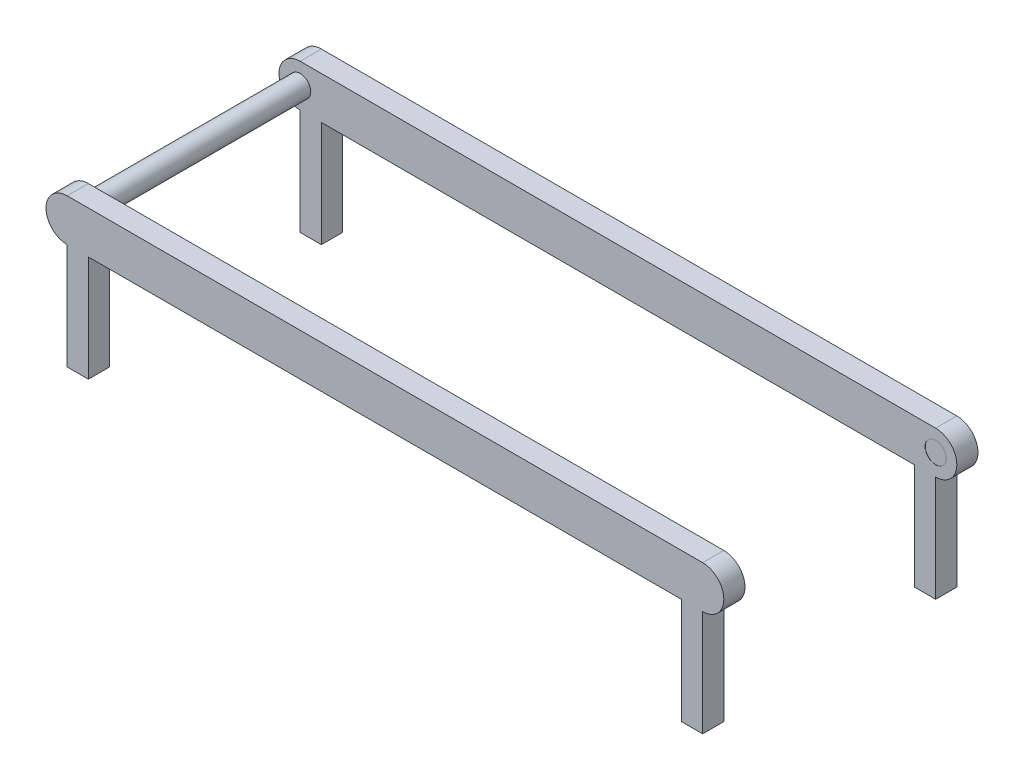
ISO-10303-21;
HEADER;
FILE_DESCRIPTION(('STEP AP214'),'2;1');
FILE_NAME('part.step','',(''),(''),'','','');
FILE_SCHEMA(('AUTOMOTIVE_DESIGN { 1 0 10303 214 1 1 1 1 }'));
ENDSEC;
DATA;
#1=APPLICATION_CONTEXT('core data for automotive mechanical design processes');
#2=APPLICATION_PROTOCOL_DEFINITION('international standard','automotive_design',2000,#1);
#3=PRODUCT_CONTEXT('',#1,'mechanical');
#4=PRODUCT('Part','Part','',(#3));
#5=PRODUCT_RELATED_PRODUCT_CATEGORY('part','',(#4));
#6=PRODUCT_DEFINITION_FORMATION('','',#4);
#7=PRODUCT_DEFINITION_CONTEXT('part definition',#1,'design');
#8=PRODUCT_DEFINITION('design','',#6,#7);
#9=PRODUCT_DEFINITION_SHAPE('','',#8);
#10=(LENGTH_UNIT() NAMED_UNIT(*) SI_UNIT(.MILLI.,.METRE.));
#11=(NAMED_UNIT(*) PLANE_ANGLE_UNIT() SI_UNIT($,.RADIAN.));
#12=(NAMED_UNIT(*) SI_UNIT($,.STERADIAN.) SOLID_ANGLE_UNIT());
#13=UNCERTAINTY_MEASURE_WITH_UNIT(LENGTH_MEASURE(1.E-05),#10,'distance_accuracy_value','');
#14=(GEOMETRIC_REPRESENTATION_CONTEXT(3) GLOBAL_UNCERTAINTY_ASSIGNED_CONTEXT((#13)) GLOBAL_UNIT_ASSIGNED_CONTEXT((#10,
#11,#12)) REPRESENTATION_CONTEXT('',''));
#15=CARTESIAN_POINT('',(0.,0.,0.));
#16=DIRECTION('',(0.,0.,1.));
#17=DIRECTION('',(1.,0.,0.));
#18=AXIS2_PLACEMENT_3D('',#15,#16,#17);
#19=CARTESIAN_POINT('',(-150.,-10.,10.));
#20=DIRECTION('',(0.,1.,0.));
#21=DIRECTION('',(0.,0.,1.));
#22=AXIS2_PLACEMENT_3D('',#19,#20,#21);
#23=PLANE('',#22);
#24=DIRECTION('',(0.,0.,1.));
#25=VECTOR('',#24,1.);
#26=CARTESIAN_POINT('',(-140.,-10.,0.));
#27=LINE('',#26,#25);
#28=CARTESIAN_POINT('',(-140.,-10.,0.));
#29=VERTEX_POINT('',#28);
#30=CARTESIAN_POINT('',(-140.,-10.,10.));
#31=VERTEX_POINT('',#30);
#32=EDGE_CURVE('E190',#29,#31,#27,.T.);
#33=ORIENTED_EDGE('',*,*,#32,.F.);
#34=DIRECTION('',(1.,0.,0.));
#35=VECTOR('',#34,1.);
#36=CARTESIAN_POINT('',(-150.,-10.,0.));
#37=LINE('',#36,#35);
#38=CARTESIAN_POINT('',(140.,-10.,0.));
#39=VERTEX_POINT('',#38);
#40=EDGE_CURVE('E319',#29,#39,#37,.T.);
#41=ORIENTED_EDGE('',*,*,#40,.T.);
#42=DIRECTION('',(0.,0.,-1.));
#43=VECTOR('',#42,1.);
#44=CARTESIAN_POINT('',(140.,-10.0000000000001,0.));
#45=LINE('',#44,#43);
#46=CARTESIAN_POINT('',(140.,-10.,10.));
#47=VERTEX_POINT('',#46);
#48=EDGE_CURVE('E194',#47,#39,#45,.T.);
#49=ORIENTED_EDGE('',*,*,#48,.F.);
#50=DIRECTION('',(1.,0.,0.));
#51=VECTOR('',#50,1.);
#52=CARTESIAN_POINT('',(-150.,-10.,10.));
#53=LINE('',#52,#51);
#54=EDGE_CURVE('E48',#31,#47,#53,.T.);
#55=ORIENTED_EDGE('',*,*,#54,.F.);
#56=EDGE_LOOP('',(#33,#41,#49,#55));
#57=FACE_BOUND('',#56,.T.);
#58=ADVANCED_FACE('F33',(#57),#23,.F.);
#59=CARTESIAN_POINT('',(-150.,-10.,120.));
#60=DIRECTION('',(0.,1.,0.));
#61=DIRECTION('',(-1.,0.,0.));
#62=AXIS2_PLACEMENT_3D('',#59,#60,#61);
#63=PLANE('',#62);
#64=DIRECTION('',(0.,0.,-1.));
#65=VECTOR('',#64,1.);
#66=CARTESIAN_POINT('',(140.,-10.0000000000001,110.));
#67=LINE('',#66,#65);
#68=CARTESIAN_POINT('',(140.,-10.0000000000001,120.));
#69=VERTEX_POINT('',#68);
#70=CARTESIAN_POINT('',(140.,-10.0000000000001,110.));
#71=VERTEX_POINT('',#70);
#72=EDGE_CURVE('E223',#69,#71,#67,.T.);
#73=ORIENTED_EDGE('',*,*,#72,.F.);
#74=DIRECTION('',(1.,0.,0.));
#75=VECTOR('',#74,1.);
#76=CARTESIAN_POINT('',(-150.,-10.,120.));
#77=LINE('',#76,#75);
#78=CARTESIAN_POINT('',(-140.,-10.,120.));
#79=VERTEX_POINT('',#78);
#80=EDGE_CURVE('E280',#79,#69,#77,.T.);
#81=ORIENTED_EDGE('',*,*,#80,.F.);
#82=DIRECTION('',(0.,0.,1.));
#83=VECTOR('',#82,1.);
#84=CARTESIAN_POINT('',(-140.,-10.,120.));
#85=LINE('',#84,#83);
#86=CARTESIAN_POINT('',(-140.,-10.,110.));
#87=VERTEX_POINT('',#86);
#88=EDGE_CURVE('E247',#87,#79,#85,.T.);
#89=ORIENTED_EDGE('',*,*,#88,.F.);
#90=DIRECTION('',(1.,0.,0.));
#91=VECTOR('',#90,1.);
#92=CARTESIAN_POINT('',(-150.,-10.,110.));
#93=LINE('',#92,#91);
#94=EDGE_CURVE('E276',#87,#71,#93,.T.);
#95=ORIENTED_EDGE('',*,*,#94,.T.);
#96=EDGE_LOOP('',(#73,#81,#89,#95));
#97=FACE_BOUND('',#96,.T.);
#98=ADVANCED_FACE('F397',(#97),#63,.F.);
#99=CARTESIAN_POINT('',(-150.,0.,10.));
#100=DIRECTION('',(0.,0.,-1.));
#101=DIRECTION('',(-1.,0.,0.));
#102=AXIS2_PLACEMENT_3D('',#99,#100,#101);
#103=CYLINDRICAL_SURFACE('',#102,10.);
#104=CARTESIAN_POINT('',(-150.,0.,0.));
#105=DIRECTION('',(0.,0.,1.));
#106=DIRECTION('',(1.,0.,0.));
#107=AXIS2_PLACEMENT_3D('',#104,#105,#106);
#108=CIRCLE('',#107,10.);
#109=CARTESIAN_POINT('',(-150.,10.,0.));
#110=VERTEX_POINT('',#109);
#111=CARTESIAN_POINT('',(-150.,-10.,0.));
#112=VERTEX_POINT('',#111);
#113=EDGE_CURVE('E306',#110,#112,#108,.T.);
#114=ORIENTED_EDGE('',*,*,#113,.T.);
#115=DIRECTION('',(0.,0.,-1.));
#116=VECTOR('',#115,1.);
#117=CARTESIAN_POINT('',(-150.,-10.,10.));
#118=LINE('',#117,#116);
#119=CARTESIAN_POINT('',(-150.,-10.,10.));
#120=VERTEX_POINT('',#119);
#121=EDGE_CURVE('E11',#120,#112,#118,.T.);
#122=ORIENTED_EDGE('',*,*,#121,.F.);
#123=CARTESIAN_POINT('',(-150.,0.,10.));
#124=DIRECTION('',(0.,0.,1.));
#125=DIRECTION('',(1.,0.,0.));
#126=AXIS2_PLACEMENT_3D('',#123,#124,#125);
#127=CIRCLE('',#126,10.);
#128=CARTESIAN_POINT('',(-150.,10.,10.));
#129=VERTEX_POINT('',#128);
#130=EDGE_CURVE('E309',#129,#120,#127,.T.);
#131=ORIENTED_EDGE('',*,*,#130,.F.);
#132=DIRECTION('',(0.,0.,-1.));
#133=VECTOR('',#132,1.);
#134=CARTESIAN_POINT('',(-150.,10.,10.));
#135=LINE('',#134,#133);
#136=EDGE_CURVE('E317',#129,#110,#135,.T.);
#137=ORIENTED_EDGE('',*,*,#136,.T.);
#138=EDGE_LOOP('',(#114,#122,#131,#137));
#139=FACE_BOUND('',#138,.T.);
#140=ADVANCED_FACE('F35',(#139),#103,.T.);
#141=CARTESIAN_POINT('',(150.,0.,10.));
#142=DIRECTION('',(0.,0.,-1.));
#143=DIRECTION('',(-1.,0.,0.));
#144=AXIS2_PLACEMENT_3D('',#141,#142,#143);
#145=CYLINDRICAL_SURFACE('',#144,10.);
#146=CARTESIAN_POINT('',(150.,0.,0.));
#147=DIRECTION('',(0.,0.,1.));
#148=DIRECTION('',(1.,0.,0.));
#149=AXIS2_PLACEMENT_3D('',#146,#147,#148);
#150=CIRCLE('',#149,10.);
#151=CARTESIAN_POINT('',(150.,-10.0000000000001,0.));
#152=VERTEX_POINT('',#151);
#153=CARTESIAN_POINT('',(150.,10.,0.));
#154=VERTEX_POINT('',#153);
#155=EDGE_CURVE('E321',#152,#154,#150,.T.);
#156=ORIENTED_EDGE('',*,*,#155,.T.);
#157=DIRECTION('',(0.,0.,-1.));
#158=VECTOR('',#157,1.);
#159=CARTESIAN_POINT('',(150.,10.,10.));
#160=LINE('',#159,#158);
#161=CARTESIAN_POINT('',(150.,10.,10.));
#162=VERTEX_POINT('',#161);
#163=EDGE_CURVE('E326',#162,#154,#160,.T.);
#164=ORIENTED_EDGE('',*,*,#163,.F.);
#165=CARTESIAN_POINT('',(150.,0.,10.));
#166=DIRECTION('',(0.,0.,1.));
#167=DIRECTION('',(1.,0.,0.));
#168=AXIS2_PLACEMENT_3D('',#165,#166,#167);
#169=CIRCLE('',#168,10.);
#170=CARTESIAN_POINT('',(150.,-10.0000000000001,10.));
#171=VERTEX_POINT('',#170);
#172=EDGE_CURVE('E313',#171,#162,#169,.T.);
#173=ORIENTED_EDGE('',*,*,#172,.F.);
#174=DIRECTION('',(0.,0.,-1.));
#175=VECTOR('',#174,1.);
#176=CARTESIAN_POINT('',(150.,-10.0000000000001,10.));
#177=LINE('',#176,#175);
#178=EDGE_CURVE('E41',#171,#152,#177,.T.);
#179=ORIENTED_EDGE('',*,*,#178,.T.);
#180=EDGE_LOOP('',(#156,#164,#173,#179));
#181=FACE_BOUND('',#180,.T.);
#182=ADVANCED_FACE('F331',(#181),#145,.T.);
#183=CARTESIAN_POINT('',(-150.,10.,10.));
#184=DIRECTION('',(0.,-1.,0.));
#185=DIRECTION('',(0.,0.,-1.));
#186=AXIS2_PLACEMENT_3D('',#183,#184,#185);
#187=PLANE('',#186);
#188=DIRECTION('',(-1.,0.,0.));
#189=VECTOR('',#188,1.);
#190=CARTESIAN_POINT('',(-150.,10.,0.));
#191=LINE('',#190,#189);
#192=EDGE_CURVE('E311',#154,#110,#191,.T.);
#193=ORIENTED_EDGE('',*,*,#192,.T.);
#194=ORIENTED_EDGE('',*,*,#136,.F.);
#195=DIRECTION('',(-1.,0.,0.));
#196=VECTOR('',#195,1.);
#197=CARTESIAN_POINT('',(-150.,10.,10.));
#198=LINE('',#197,#196);
#199=EDGE_CURVE('E315',#162,#129,#198,.T.);
#200=ORIENTED_EDGE('',*,*,#199,.F.);
#201=ORIENTED_EDGE('',*,*,#163,.T.);
#202=EDGE_LOOP('',(#193,#194,#200,#201));
#203=FACE_BOUND('',#202,.T.);
#204=ADVANCED_FACE('F342',(#203),#187,.F.);
#205=CARTESIAN_POINT('',(-150.,0.,10.));
#206=DIRECTION('',(0.,0.,1.));
#207=DIRECTION('',(1.,0.,0.));
#208=AXIS2_PLACEMENT_3D('',#205,#206,#207);
#209=PLANE('',#208);
#210=CARTESIAN_POINT('',(150.,0.,10.));
#211=DIRECTION('',(0.,0.,1.));
#212=DIRECTION('',(1.,0.,0.));
#213=AXIS2_PLACEMENT_3D('',#210,#211,#212);
#214=CIRCLE('',#213,5.00000000000002);
#215=CARTESIAN_POINT('',(155.,0.,10.));
#216=VERTEX_POINT('',#215);
#217=EDGE_CURVE('E363',#216,#216,#214,.T.);
#218=ORIENTED_EDGE('',*,*,#217,.F.);
#219=EDGE_LOOP('',(#218));
#220=FACE_BOUND('',#219,.T.);
#221=CARTESIAN_POINT('',(-150.,0.,10.));
#222=DIRECTION('',(0.,0.,1.));
#223=DIRECTION('',(1.,0.,0.));
#224=AXIS2_PLACEMENT_3D('',#221,#222,#223);
#225=CIRCLE('',#224,4.99999999999999);
#226=CARTESIAN_POINT('',(-145.,0.,10.));
#227=VERTEX_POINT('',#226);
#228=EDGE_CURVE('E302',#227,#227,#225,.T.);
#229=ORIENTED_EDGE('',*,*,#228,.F.);
#230=EDGE_LOOP('',(#229));
#231=FACE_BOUND('',#230,.T.);
#232=ORIENTED_EDGE('',*,*,#130,.T.);
#233=DIRECTION('',(0.,1.,0.));
#234=VECTOR('',#233,1.);
#235=CARTESIAN_POINT('',(-150.,-60.,10.));
#236=LINE('',#235,#234);
#237=CARTESIAN_POINT('',(-150.,-60.,10.));
#238=VERTEX_POINT('',#237);
#239=EDGE_CURVE('E347',#238,#120,#236,.T.);
#240=ORIENTED_EDGE('',*,*,#239,.F.);
#241=DIRECTION('',(-1.,0.,0.));
#242=VECTOR('',#241,1.);
#243=CARTESIAN_POINT('',(-150.,-60.,10.));
#244=LINE('',#243,#242);
#245=CARTESIAN_POINT('',(-140.,-60.,10.));
#246=VERTEX_POINT('',#245);
#247=EDGE_CURVE('E186',#246,#238,#244,.T.);
#248=ORIENTED_EDGE('',*,*,#247,.F.);
#249=DIRECTION('',(0.,1.,0.));
#250=VECTOR('',#249,1.);
#251=CARTESIAN_POINT('',(-140.,-60.,10.));
#252=LINE('',#251,#250);
#253=EDGE_CURVE('E199',#246,#31,#252,.T.);
#254=ORIENTED_EDGE('',*,*,#253,.T.);
#255=ORIENTED_EDGE('',*,*,#54,.T.);
#256=DIRECTION('',(0.,1.,0.));
#257=VECTOR('',#256,1.);
#258=CARTESIAN_POINT('',(140.,-60.0000000000001,10.));
#259=LINE('',#258,#257);
#260=CARTESIAN_POINT('',(140.,-60.0000000000001,10.));
#261=VERTEX_POINT('',#260);
#262=EDGE_CURVE('E217',#261,#47,#259,.T.);
#263=ORIENTED_EDGE('',*,*,#262,.F.);
#264=DIRECTION('',(-1.,0.,0.));
#265=VECTOR('',#264,1.);
#266=CARTESIAN_POINT('',(150.,-60.0000000000001,10.));
#267=LINE('',#266,#265);
#268=CARTESIAN_POINT('',(150.,-60.0000000000001,10.));
#269=VERTEX_POINT('',#268);
#270=EDGE_CURVE('E205',#269,#261,#267,.T.);
#271=ORIENTED_EDGE('',*,*,#270,.F.);
#272=DIRECTION('',(0.,1.,0.));
#273=VECTOR('',#272,1.);
#274=CARTESIAN_POINT('',(150.,-60.0000000000001,10.));
#275=LINE('',#274,#273);
#276=EDGE_CURVE('E220',#269,#171,#275,.T.);
#277=ORIENTED_EDGE('',*,*,#276,.T.);
#278=ORIENTED_EDGE('',*,*,#172,.T.);
#279=ORIENTED_EDGE('',*,*,#199,.T.);
#280=EDGE_LOOP('',(#232,#240,#248,#254,#255,#263,#271,#277,#278,#279));
#281=FACE_BOUND('',#280,.T.);
#282=ADVANCED_FACE('F346',(#220,#231,#281),#209,.T.);
#283=CARTESIAN_POINT('',(-150.,0.,0.));
#284=DIRECTION('',(0.,0.,1.));
#285=DIRECTION('',(1.,0.,0.));
#286=AXIS2_PLACEMENT_3D('',#283,#284,#285);
#287=PLANE('',#286);
#288=ORIENTED_EDGE('',*,*,#113,.F.);
#289=ORIENTED_EDGE('',*,*,#192,.F.);
#290=ORIENTED_EDGE('',*,*,#155,.F.);
#291=DIRECTION('',(0.,1.,0.));
#292=VECTOR('',#291,1.);
#293=CARTESIAN_POINT('',(150.,-60.0000000000001,0.));
#294=LINE('',#293,#292);
#295=CARTESIAN_POINT('',(150.,-60.0000000000001,0.));
#296=VERTEX_POINT('',#295);
#297=EDGE_CURVE('E210',#296,#152,#294,.T.);
#298=ORIENTED_EDGE('',*,*,#297,.F.);
#299=DIRECTION('',(1.,0.,0.));
#300=VECTOR('',#299,1.);
#301=CARTESIAN_POINT('',(150.,-60.0000000000001,0.));
#302=LINE('',#301,#300);
#303=CARTESIAN_POINT('',(140.,-60.0000000000001,0.));
#304=VERTEX_POINT('',#303);
#305=EDGE_CURVE('E209',#304,#296,#302,.T.);
#306=ORIENTED_EDGE('',*,*,#305,.F.);
#307=DIRECTION('',(0.,1.,0.));
#308=VECTOR('',#307,1.);
#309=CARTESIAN_POINT('',(140.,-60.0000000000001,0.));
#310=LINE('',#309,#308);
#311=EDGE_CURVE('E214',#304,#39,#310,.T.);
#312=ORIENTED_EDGE('',*,*,#311,.T.);
#313=ORIENTED_EDGE('',*,*,#40,.F.);
#314=DIRECTION('',(0.,1.,0.));
#315=VECTOR('',#314,1.);
#316=CARTESIAN_POINT('',(-140.,-60.,0.));
#317=LINE('',#316,#315);
#318=CARTESIAN_POINT('',(-140.,-60.,0.));
#319=VERTEX_POINT('',#318);
#320=EDGE_CURVE('E177',#319,#29,#317,.T.);
#321=ORIENTED_EDGE('',*,*,#320,.F.);
#322=DIRECTION('',(1.,0.,0.));
#323=VECTOR('',#322,1.);
#324=CARTESIAN_POINT('',(-150.,-60.,0.));
#325=LINE('',#324,#323);
#326=CARTESIAN_POINT('',(-150.,-60.,0.));
#327=VERTEX_POINT('',#326);
#328=EDGE_CURVE('E170',#327,#319,#325,.T.);
#329=ORIENTED_EDGE('',*,*,#328,.F.);
#330=DIRECTION('',(0.,1.,0.));
#331=VECTOR('',#330,1.);
#332=CARTESIAN_POINT('',(-150.,-60.,0.));
#333=LINE('',#332,#331);
#334=EDGE_CURVE('E175',#327,#112,#333,.T.);
#335=ORIENTED_EDGE('',*,*,#334,.T.);
#336=EDGE_LOOP('',(#288,#289,#290,#298,#306,#312,#313,#321,#329,#335));
#337=FACE_BOUND('',#336,.T.);
#338=ADVANCED_FACE('F173',(#337),#287,.F.);
#339=CARTESIAN_POINT('',(-150.,0.,110.));
#340=DIRECTION('',(0.,0.,-1.));
#341=DIRECTION('',(-1.,0.,0.));
#342=AXIS2_PLACEMENT_3D('',#339,#340,#341);
#343=CYLINDRICAL_SURFACE('',#342,4.99999999999999);
#344=CARTESIAN_POINT('',(-150.,0.,110.));
#345=DIRECTION('',(0.,0.,1.));
#346=DIRECTION('',(1.,0.,0.));
#347=AXIS2_PLACEMENT_3D('',#344,#345,#346);
#348=CIRCLE('',#347,4.99999999999999);
#349=CARTESIAN_POINT('',(-145.,0.,110.));
#350=VERTEX_POINT('',#349);
#351=EDGE_CURVE('E303',#350,#350,#348,.T.);
#352=ORIENTED_EDGE('',*,*,#351,.F.);
#353=EDGE_LOOP('',(#352));
#354=FACE_BOUND('',#353,.T.);
#355=ORIENTED_EDGE('',*,*,#228,.T.);
#356=EDGE_LOOP('',(#355));
#357=FACE_BOUND('',#356,.T.);
#358=ADVANCED_FACE('F382',(#354,#357),#343,.T.);
#359=CARTESIAN_POINT('',(150.,0.,120.));
#360=DIRECTION('',(0.,0.,-1.));
#361=DIRECTION('',(-1.,0.,0.));
#362=AXIS2_PLACEMENT_3D('',#359,#360,#361);
#363=CYLINDRICAL_SURFACE('',#362,10.);
#364=CARTESIAN_POINT('',(150.,0.,110.));
#365=DIRECTION('',(0.,0.,1.));
#366=DIRECTION('',(1.,0.,0.));
#367=AXIS2_PLACEMENT_3D('',#364,#365,#366);
#368=CIRCLE('',#367,10.);
#369=CARTESIAN_POINT('',(150.,-10.0000000000001,110.));
#370=VERTEX_POINT('',#369);
#371=CARTESIAN_POINT('',(150.,10.,110.));
#372=VERTEX_POINT('',#371);
#373=EDGE_CURVE('E271',#370,#372,#368,.T.);
#374=ORIENTED_EDGE('',*,*,#373,.T.);
#375=DIRECTION('',(0.,0.,-1.));
#376=VECTOR('',#375,1.);
#377=CARTESIAN_POINT('',(150.,10.,120.));
#378=LINE('',#377,#376);
#379=CARTESIAN_POINT('',(150.,10.,120.));
#380=VERTEX_POINT('',#379);
#381=EDGE_CURVE('E299',#380,#372,#378,.T.);
#382=ORIENTED_EDGE('',*,*,#381,.F.);
#383=CARTESIAN_POINT('',(150.,0.,120.));
#384=DIRECTION('',(0.,0.,1.));
#385=DIRECTION('',(1.,0.,0.));
#386=AXIS2_PLACEMENT_3D('',#383,#384,#385);
#387=CIRCLE('',#386,10.);
#388=CARTESIAN_POINT('',(150.,-10.0000000000001,120.));
#389=VERTEX_POINT('',#388);
#390=EDGE_CURVE('E272',#389,#380,#387,.T.);
#391=ORIENTED_EDGE('',*,*,#390,.F.);
#392=DIRECTION('',(0.,0.,-1.));
#393=VECTOR('',#392,1.);
#394=CARTESIAN_POINT('',(150.,-10.0000000000001,120.));
#395=LINE('',#394,#393);
#396=EDGE_CURVE('E283',#389,#370,#395,.T.);
#397=ORIENTED_EDGE('',*,*,#396,.T.);
#398=EDGE_LOOP('',(#374,#382,#391,#397));
#399=FACE_BOUND('',#398,.T.);
#400=ADVANCED_FACE('F384',(#399),#363,.T.);
#401=CARTESIAN_POINT('',(-150.,10.,120.));
#402=DIRECTION('',(0.,-1.,0.));
#403=DIRECTION('',(0.,0.,-1.));
#404=AXIS2_PLACEMENT_3D('',#401,#402,#403);
#405=PLANE('',#404);
#406=DIRECTION('',(-1.,0.,0.));
#407=VECTOR('',#406,1.);
#408=CARTESIAN_POINT('',(-150.,10.,110.));
#409=LINE('',#408,#407);
#410=CARTESIAN_POINT('',(-150.,10.,110.));
#411=VERTEX_POINT('',#410);
#412=EDGE_CURVE('E286',#372,#411,#409,.T.);
#413=ORIENTED_EDGE('',*,*,#412,.T.);
#414=DIRECTION('',(0.,0.,-1.));
#415=VECTOR('',#414,1.);
#416=CARTESIAN_POINT('',(-150.,10.,120.));
#417=LINE('',#416,#415);
#418=CARTESIAN_POINT('',(-150.,10.,120.));
#419=VERTEX_POINT('',#418);
#420=EDGE_CURVE('E296',#419,#411,#417,.T.);
#421=ORIENTED_EDGE('',*,*,#420,.F.);
#422=DIRECTION('',(-1.,0.,0.));
#423=VECTOR('',#422,1.);
#424=CARTESIAN_POINT('',(-150.,10.,120.));
#425=LINE('',#424,#423);
#426=EDGE_CURVE('E275',#380,#419,#425,.T.);
#427=ORIENTED_EDGE('',*,*,#426,.F.);
#428=ORIENTED_EDGE('',*,*,#381,.T.);
#429=EDGE_LOOP('',(#413,#421,#427,#428));
#430=FACE_BOUND('',#429,.T.);
#431=ADVANCED_FACE('F391',(#430),#405,.F.);
#432=CARTESIAN_POINT('',(-150.,0.,120.));
#433=DIRECTION('',(0.,0.,-1.));
#434=DIRECTION('',(-1.,0.,0.));
#435=AXIS2_PLACEMENT_3D('',#432,#433,#434);
#436=CYLINDRICAL_SURFACE('',#435,10.);
#437=CARTESIAN_POINT('',(-150.,0.,110.));
#438=DIRECTION('',(0.,0.,1.));
#439=DIRECTION('',(-1.,0.,0.));
#440=AXIS2_PLACEMENT_3D('',#437,#438,#439);
#441=CIRCLE('',#440,10.);
#442=CARTESIAN_POINT('',(-150.,-10.,110.));
#443=VERTEX_POINT('',#442);
#444=EDGE_CURVE('E288',#411,#443,#441,.T.);
#445=ORIENTED_EDGE('',*,*,#444,.T.);
#446=DIRECTION('',(0.,0.,-1.));
#447=VECTOR('',#446,1.);
#448=CARTESIAN_POINT('',(-150.,-10.,120.));
#449=LINE('',#448,#447);
#450=CARTESIAN_POINT('',(-150.,-10.,120.));
#451=VERTEX_POINT('',#450);
#452=EDGE_CURVE('E293',#451,#443,#449,.T.);
#453=ORIENTED_EDGE('',*,*,#452,.F.);
#454=CARTESIAN_POINT('',(-150.,0.,120.));
#455=DIRECTION('',(0.,0.,1.));
#456=DIRECTION('',(-1.,0.,0.));
#457=AXIS2_PLACEMENT_3D('',#454,#455,#456);
#458=CIRCLE('',#457,10.);
#459=EDGE_CURVE('E278',#419,#451,#458,.T.);
#460=ORIENTED_EDGE('',*,*,#459,.F.);
#461=ORIENTED_EDGE('',*,*,#420,.T.);
#462=EDGE_LOOP('',(#445,#453,#460,#461));
#463=FACE_BOUND('',#462,.T.);
#464=ADVANCED_FACE('F441',(#463),#436,.T.);
#465=CARTESIAN_POINT('',(150.,0.,120.));
#466=DIRECTION('',(0.,0.,1.));
#467=DIRECTION('',(1.,0.,0.));
#468=AXIS2_PLACEMENT_3D('',#465,#466,#467);
#469=PLANE('',#468);
#470=ORIENTED_EDGE('',*,*,#390,.T.);
#471=ORIENTED_EDGE('',*,*,#426,.T.);
#472=ORIENTED_EDGE('',*,*,#459,.T.);
#473=DIRECTION('',(0.,1.,0.));
#474=VECTOR('',#473,1.);
#475=CARTESIAN_POINT('',(-150.,-60.,120.));
#476=LINE('',#475,#474);
#477=CARTESIAN_POINT('',(-150.,-60.,120.));
#478=VERTEX_POINT('',#477);
#479=EDGE_CURVE('E257',#478,#451,#476,.T.);
#480=ORIENTED_EDGE('',*,*,#479,.F.);
#481=DIRECTION('',(-1.,0.,0.));
#482=VECTOR('',#481,1.);
#483=CARTESIAN_POINT('',(-150.,-60.,120.));
#484=LINE('',#483,#482);
#485=CARTESIAN_POINT('',(-140.,-60.,120.));
#486=VERTEX_POINT('',#485);
#487=EDGE_CURVE('E255',#486,#478,#484,.T.);
#488=ORIENTED_EDGE('',*,*,#487,.F.);
#489=DIRECTION('',(0.,1.,0.));
#490=VECTOR('',#489,1.);
#491=CARTESIAN_POINT('',(-140.,-60.,120.));
#492=LINE('',#491,#490);
#493=EDGE_CURVE('E262',#486,#79,#492,.T.);
#494=ORIENTED_EDGE('',*,*,#493,.T.);
#495=ORIENTED_EDGE('',*,*,#80,.T.);
#496=DIRECTION('',(0.,1.,0.));
#497=VECTOR('',#496,1.);
#498=CARTESIAN_POINT('',(140.,-60.0000000000001,120.));
#499=LINE('',#498,#497);
#500=CARTESIAN_POINT('',(140.,-60.0000000000001,120.));
#501=VERTEX_POINT('',#500);
#502=EDGE_CURVE('E241',#501,#69,#499,.T.);
#503=ORIENTED_EDGE('',*,*,#502,.F.);
#504=DIRECTION('',(-1.,0.,0.));
#505=VECTOR('',#504,1.);
#506=CARTESIAN_POINT('',(150.,-60.0000000000001,120.));
#507=LINE('',#506,#505);
#508=CARTESIAN_POINT('',(150.,-60.0000000000001,120.));
#509=VERTEX_POINT('',#508);
#510=EDGE_CURVE('E227',#509,#501,#507,.T.);
#511=ORIENTED_EDGE('',*,*,#510,.F.);
#512=DIRECTION('',(0.,1.,0.));
#513=VECTOR('',#512,1.);
#514=CARTESIAN_POINT('',(150.,-60.0000000000001,120.));
#515=LINE('',#514,#513);
#516=EDGE_CURVE('E244',#509,#389,#515,.T.);
#517=ORIENTED_EDGE('',*,*,#516,.T.);
#518=EDGE_LOOP('',(#470,#471,#472,#480,#488,#494,#495,#503,#511,#517));
#519=FACE_BOUND('',#518,.T.);
#520=ADVANCED_FACE('F446',(#519),#469,.T.);
#521=CARTESIAN_POINT('',(150.,0.,110.));
#522=DIRECTION('',(0.,0.,1.));
#523=DIRECTION('',(1.,0.,0.));
#524=AXIS2_PLACEMENT_3D('',#521,#522,#523);
#525=PLANE('',#524);
#526=ORIENTED_EDGE('',*,*,#351,.T.);
#527=EDGE_LOOP('',(#526));
#528=FACE_BOUND('',#527,.T.);
#529=ORIENTED_EDGE('',*,*,#373,.F.);
#530=DIRECTION('',(0.,1.,0.));
#531=VECTOR('',#530,1.);
#532=CARTESIAN_POINT('',(150.,-60.0000000000001,110.));
#533=LINE('',#532,#531);
#534=CARTESIAN_POINT('',(150.,-60.0000000000001,110.));
#535=VERTEX_POINT('',#534);
#536=EDGE_CURVE('E233',#535,#370,#533,.T.);
#537=ORIENTED_EDGE('',*,*,#536,.F.);
#538=DIRECTION('',(1.,0.,0.));
#539=VECTOR('',#538,1.);
#540=CARTESIAN_POINT('',(150.,-60.0000000000001,110.));
#541=LINE('',#540,#539);
#542=CARTESIAN_POINT('',(140.,-60.0000000000001,110.));
#543=VERTEX_POINT('',#542);
#544=EDGE_CURVE('E231',#543,#535,#541,.T.);
#545=ORIENTED_EDGE('',*,*,#544,.F.);
#546=DIRECTION('',(0.,1.,0.));
#547=VECTOR('',#546,1.);
#548=CARTESIAN_POINT('',(140.,-60.0000000000001,110.));
#549=LINE('',#548,#547);
#550=EDGE_CURVE('E238',#543,#71,#549,.T.);
#551=ORIENTED_EDGE('',*,*,#550,.T.);
#552=ORIENTED_EDGE('',*,*,#94,.F.);
#553=DIRECTION('',(0.,1.,0.));
#554=VECTOR('',#553,1.);
#555=CARTESIAN_POINT('',(-140.,-60.,110.));
#556=LINE('',#555,#554);
#557=CARTESIAN_POINT('',(-140.,-60.,110.));
#558=VERTEX_POINT('',#557);
#559=EDGE_CURVE('E265',#558,#87,#556,.T.);
#560=ORIENTED_EDGE('',*,*,#559,.F.);
#561=DIRECTION('',(1.,0.,0.));
#562=VECTOR('',#561,1.);
#563=CARTESIAN_POINT('',(-150.,-60.,110.));
#564=LINE('',#563,#562);
#565=CARTESIAN_POINT('',(-150.,-60.,110.));
#566=VERTEX_POINT('',#565);
#567=EDGE_CURVE('E251',#566,#558,#564,.T.);
#568=ORIENTED_EDGE('',*,*,#567,.F.);
#569=DIRECTION('',(0.,1.,0.));
#570=VECTOR('',#569,1.);
#571=CARTESIAN_POINT('',(-150.,-60.,110.));
#572=LINE('',#571,#570);
#573=EDGE_CURVE('E268',#566,#443,#572,.T.);
#574=ORIENTED_EDGE('',*,*,#573,.T.);
#575=ORIENTED_EDGE('',*,*,#444,.F.);
#576=ORIENTED_EDGE('',*,*,#412,.F.);
#577=EDGE_LOOP('',(#529,#537,#545,#551,#552,#560,#568,#574,#575,#576));
#578=FACE_BOUND('',#577,.T.);
#579=ADVANCED_FACE('F457',(#528,#578),#525,.F.);
#580=CARTESIAN_POINT('',(-150.,-60.,120.));
#581=DIRECTION('',(1.,0.,0.));
#582=DIRECTION('',(0.,1.,0.));
#583=AXIS2_PLACEMENT_3D('',#580,#581,#582);
#584=PLANE('',#583);
#585=ORIENTED_EDGE('',*,*,#452,.T.);
#586=ORIENTED_EDGE('',*,*,#573,.F.);
#587=DIRECTION('',(0.,0.,-1.));
#588=VECTOR('',#587,1.);
#589=CARTESIAN_POINT('',(-150.,-60.,120.));
#590=LINE('',#589,#588);
#591=EDGE_CURVE('E248',#478,#566,#590,.T.);
#592=ORIENTED_EDGE('',*,*,#591,.F.);
#593=ORIENTED_EDGE('',*,*,#479,.T.);
#594=EDGE_LOOP('',(#585,#586,#592,#593));
#595=FACE_BOUND('',#594,.T.);
#596=ADVANCED_FACE('F468',(#595),#584,.F.);
#597=CARTESIAN_POINT('',(-140.,-60.,120.));
#598=DIRECTION('',(-1.,0.,0.));
#599=DIRECTION('',(0.,-1.,0.));
#600=AXIS2_PLACEMENT_3D('',#597,#598,#599);
#601=PLANE('',#600);
#602=ORIENTED_EDGE('',*,*,#88,.T.);
#603=ORIENTED_EDGE('',*,*,#493,.F.);
#604=DIRECTION('',(0.,0.,1.));
#605=VECTOR('',#604,1.);
#606=CARTESIAN_POINT('',(-140.,-60.,120.));
#607=LINE('',#606,#605);
#608=EDGE_CURVE('E253',#558,#486,#607,.T.);
#609=ORIENTED_EDGE('',*,*,#608,.F.);
#610=ORIENTED_EDGE('',*,*,#559,.T.);
#611=EDGE_LOOP('',(#602,#603,#609,#610));
#612=FACE_BOUND('',#611,.T.);
#613=ADVANCED_FACE('F478',(#612),#601,.F.);
#614=CARTESIAN_POINT('',(0.,-60.,0.));
#615=DIRECTION('',(0.,-1.,0.));
#616=DIRECTION('',(0.,0.,-1.));
#617=AXIS2_PLACEMENT_3D('',#614,#615,#616);
#618=PLANE('',#617);
#619=ORIENTED_EDGE('',*,*,#591,.T.);
#620=ORIENTED_EDGE('',*,*,#567,.T.);
#621=ORIENTED_EDGE('',*,*,#608,.T.);
#622=ORIENTED_EDGE('',*,*,#487,.T.);
#623=EDGE_LOOP('',(#619,#620,#621,#622));
#624=FACE_BOUND('',#623,.T.);
#625=ADVANCED_FACE('F488',(#624),#618,.T.);
#626=CARTESIAN_POINT('',(150.,-60.0000000000001,110.));
#627=DIRECTION('',(-1.,0.,0.));
#628=DIRECTION('',(0.,-1.,0.));
#629=AXIS2_PLACEMENT_3D('',#626,#627,#628);
#630=PLANE('',#629);
#631=ORIENTED_EDGE('',*,*,#396,.F.);
#632=ORIENTED_EDGE('',*,*,#516,.F.);
#633=DIRECTION('',(0.,0.,1.));
#634=VECTOR('',#633,1.);
#635=CARTESIAN_POINT('',(150.,-60.0000000000001,110.));
#636=LINE('',#635,#634);
#637=EDGE_CURVE('E224',#535,#509,#636,.T.);
#638=ORIENTED_EDGE('',*,*,#637,.F.);
#639=ORIENTED_EDGE('',*,*,#536,.T.);
#640=EDGE_LOOP('',(#631,#632,#638,#639));
#641=FACE_BOUND('',#640,.T.);
#642=ADVANCED_FACE('F498',(#641),#630,.F.);
#643=CARTESIAN_POINT('',(140.,-60.0000000000001,110.));
#644=DIRECTION('',(1.,0.,0.));
#645=DIRECTION('',(0.,0.,-1.));
#646=AXIS2_PLACEMENT_3D('',#643,#644,#645);
#647=PLANE('',#646);
#648=ORIENTED_EDGE('',*,*,#72,.T.);
#649=ORIENTED_EDGE('',*,*,#550,.F.);
#650=DIRECTION('',(0.,0.,-1.));
#651=VECTOR('',#650,1.);
#652=CARTESIAN_POINT('',(140.,-60.0000000000001,110.));
#653=LINE('',#652,#651);
#654=EDGE_CURVE('E229',#501,#543,#653,.T.);
#655=ORIENTED_EDGE('',*,*,#654,.F.);
#656=ORIENTED_EDGE('',*,*,#502,.T.);
#657=EDGE_LOOP('',(#648,#649,#655,#656));
#658=FACE_BOUND('',#657,.T.);
#659=ADVANCED_FACE('F508',(#658),#647,.F.);
#660=CARTESIAN_POINT('',(0.,-60.0000000000001,0.));
#661=DIRECTION('',(0.,-1.,0.));
#662=DIRECTION('',(0.,0.,-1.));
#663=AXIS2_PLACEMENT_3D('',#660,#661,#662);
#664=PLANE('',#663);
#665=ORIENTED_EDGE('',*,*,#637,.T.);
#666=ORIENTED_EDGE('',*,*,#510,.T.);
#667=ORIENTED_EDGE('',*,*,#654,.T.);
#668=ORIENTED_EDGE('',*,*,#544,.T.);
#669=EDGE_LOOP('',(#665,#666,#667,#668));
#670=FACE_BOUND('',#669,.T.);
#671=ADVANCED_FACE('F518',(#670),#664,.T.);
#672=CARTESIAN_POINT('',(150.,-60.0000000000001,0.));
#673=DIRECTION('',(-1.,0.,0.));
#674=DIRECTION('',(0.,-1.,0.));
#675=AXIS2_PLACEMENT_3D('',#672,#673,#674);
#676=PLANE('',#675);
#677=ORIENTED_EDGE('',*,*,#178,.F.);
#678=ORIENTED_EDGE('',*,*,#276,.F.);
#679=DIRECTION('',(0.,0.,1.));
#680=VECTOR('',#679,1.);
#681=CARTESIAN_POINT('',(150.,-60.0000000000001,0.));
#682=LINE('',#681,#680);
#683=EDGE_CURVE('E197',#296,#269,#682,.T.);
#684=ORIENTED_EDGE('',*,*,#683,.F.);
#685=ORIENTED_EDGE('',*,*,#297,.T.);
#686=EDGE_LOOP('',(#677,#678,#684,#685));
#687=FACE_BOUND('',#686,.T.);
#688=ADVANCED_FACE('F337',(#687),#676,.F.);
#689=CARTESIAN_POINT('',(140.,-60.0000000000001,0.));
#690=DIRECTION('',(1.,0.,0.));
#691=DIRECTION('',(0.,1.,0.));
#692=AXIS2_PLACEMENT_3D('',#689,#690,#691);
#693=PLANE('',#692);
#694=ORIENTED_EDGE('',*,*,#48,.T.);
#695=ORIENTED_EDGE('',*,*,#311,.F.);
#696=DIRECTION('',(0.,0.,-1.));
#697=VECTOR('',#696,1.);
#698=CARTESIAN_POINT('',(140.,-60.0000000000001,0.));
#699=LINE('',#698,#697);
#700=EDGE_CURVE('E207',#261,#304,#699,.T.);
#701=ORIENTED_EDGE('',*,*,#700,.F.);
#702=ORIENTED_EDGE('',*,*,#262,.T.);
#703=EDGE_LOOP('',(#694,#695,#701,#702));
#704=FACE_BOUND('',#703,.T.);
#705=ADVANCED_FACE('F353',(#704),#693,.F.);
#706=CARTESIAN_POINT('',(0.,-60.0000000000001,0.));
#707=DIRECTION('',(0.,-1.,0.));
#708=DIRECTION('',(0.,0.,-1.));
#709=AXIS2_PLACEMENT_3D('',#706,#707,#708);
#710=PLANE('',#709);
#711=ORIENTED_EDGE('',*,*,#683,.T.);
#712=ORIENTED_EDGE('',*,*,#270,.T.);
#713=ORIENTED_EDGE('',*,*,#700,.T.);
#714=ORIENTED_EDGE('',*,*,#305,.T.);
#715=EDGE_LOOP('',(#711,#712,#713,#714));
#716=FACE_BOUND('',#715,.T.);
#717=ADVANCED_FACE('F350',(#716),#710,.T.);
#718=CARTESIAN_POINT('',(-150.,-60.,0.));
#719=DIRECTION('',(1.,0.,0.));
#720=DIRECTION('',(0.,1.,0.));
#721=AXIS2_PLACEMENT_3D('',#718,#719,#720);
#722=PLANE('',#721);
#723=ORIENTED_EDGE('',*,*,#121,.T.);
#724=ORIENTED_EDGE('',*,*,#334,.F.);
#725=DIRECTION('',(0.,0.,-1.));
#726=VECTOR('',#725,1.);
#727=CARTESIAN_POINT('',(-150.,-60.,0.));
#728=LINE('',#727,#726);
#729=EDGE_CURVE('E181',#238,#327,#728,.T.);
#730=ORIENTED_EDGE('',*,*,#729,.F.);
#731=ORIENTED_EDGE('',*,*,#239,.T.);
#732=EDGE_LOOP('',(#723,#724,#730,#731));
#733=FACE_BOUND('',#732,.T.);
#734=ADVANCED_FACE('F192',(#733),#722,.F.);
#735=CARTESIAN_POINT('',(-140.,-60.,0.));
#736=DIRECTION('',(-1.,0.,0.));
#737=DIRECTION('',(0.,-1.,0.));
#738=AXIS2_PLACEMENT_3D('',#735,#736,#737);
#739=PLANE('',#738);
#740=ORIENTED_EDGE('',*,*,#32,.T.);
#741=ORIENTED_EDGE('',*,*,#253,.F.);
#742=DIRECTION('',(0.,0.,1.));
#743=VECTOR('',#742,1.);
#744=CARTESIAN_POINT('',(-140.,-60.,0.));
#745=LINE('',#744,#743);
#746=EDGE_CURVE('E180',#319,#246,#745,.T.);
#747=ORIENTED_EDGE('',*,*,#746,.F.);
#748=ORIENTED_EDGE('',*,*,#320,.T.);
#749=EDGE_LOOP('',(#740,#741,#747,#748));
#750=FACE_BOUND('',#749,.T.);
#751=ADVANCED_FACE('F358',(#750),#739,.F.);
#752=CARTESIAN_POINT('',(0.,-60.,0.));
#753=DIRECTION('',(0.,1.,0.));
#754=DIRECTION('',(0.,0.,1.));
#755=AXIS2_PLACEMENT_3D('',#752,#753,#754);
#756=PLANE('',#755);
#757=ORIENTED_EDGE('',*,*,#729,.T.);
#758=ORIENTED_EDGE('',*,*,#328,.T.);
#759=ORIENTED_EDGE('',*,*,#746,.T.);
#760=ORIENTED_EDGE('',*,*,#247,.T.);
#761=EDGE_LOOP('',(#757,#758,#759,#760));
#762=FACE_BOUND('',#761,.T.);
#763=ADVANCED_FACE('F184',(#762),#756,.F.);
#764=CARTESIAN_POINT('',(150.,0.,9.9));
#765=DIRECTION('',(0.,0.,1.));
#766=DIRECTION('',(1.,0.,0.));
#767=AXIS2_PLACEMENT_3D('',#764,#765,#766);
#768=CYLINDRICAL_SURFACE('',#767,5.00000000000002);
#769=CARTESIAN_POINT('',(150.,0.,9.9));
#770=DIRECTION('',(0.,0.,1.));
#771=DIRECTION('',(1.,0.,0.));
#772=AXIS2_PLACEMENT_3D('',#769,#770,#771);
#773=CIRCLE('',#772,5.00000000000002);
#774=CARTESIAN_POINT('',(155.,0.,9.9));
#775=VERTEX_POINT('',#774);
#776=EDGE_CURVE('E356',#775,#775,#773,.T.);
#777=ORIENTED_EDGE('',*,*,#776,.F.);
#778=EDGE_LOOP('',(#777));
#779=FACE_BOUND('',#778,.T.);
#780=ORIENTED_EDGE('',*,*,#217,.T.);
#781=EDGE_LOOP('',(#780));
#782=FACE_BOUND('',#781,.T.);
#783=ADVANCED_FACE('F371',(#779,#782),#768,.F.);
#784=CARTESIAN_POINT('',(150.,0.,9.9));
#785=DIRECTION('',(0.,0.,1.));
#786=DIRECTION('',(1.,0.,0.));
#787=AXIS2_PLACEMENT_3D('',#784,#785,#786);
#788=PLANE('',#787);
#789=ORIENTED_EDGE('',*,*,#776,.T.);
#790=EDGE_LOOP('',(#789));
#791=FACE_BOUND('',#790,.T.);
#792=ADVANCED_FACE('F369',(#791),#788,.T.);
#793=CLOSED_SHELL('',(#58,#98,#140,#182,#204,#282,#338,#358,#400,#431,#464,#520,#579,#596,#613,
#625,#642,#659,#671,#688,#705,#717,#734,#751,#763,#783,#792));
#794=MANIFOLD_SOLID_BREP('B2',#793);
#795=ADVANCED_BREP_SHAPE_REPRESENTATION('',(#18,#794),#14);
#796=SHAPE_DEFINITION_REPRESENTATION(#9,#795);
ENDSEC;
END-ISO-10303-21;
